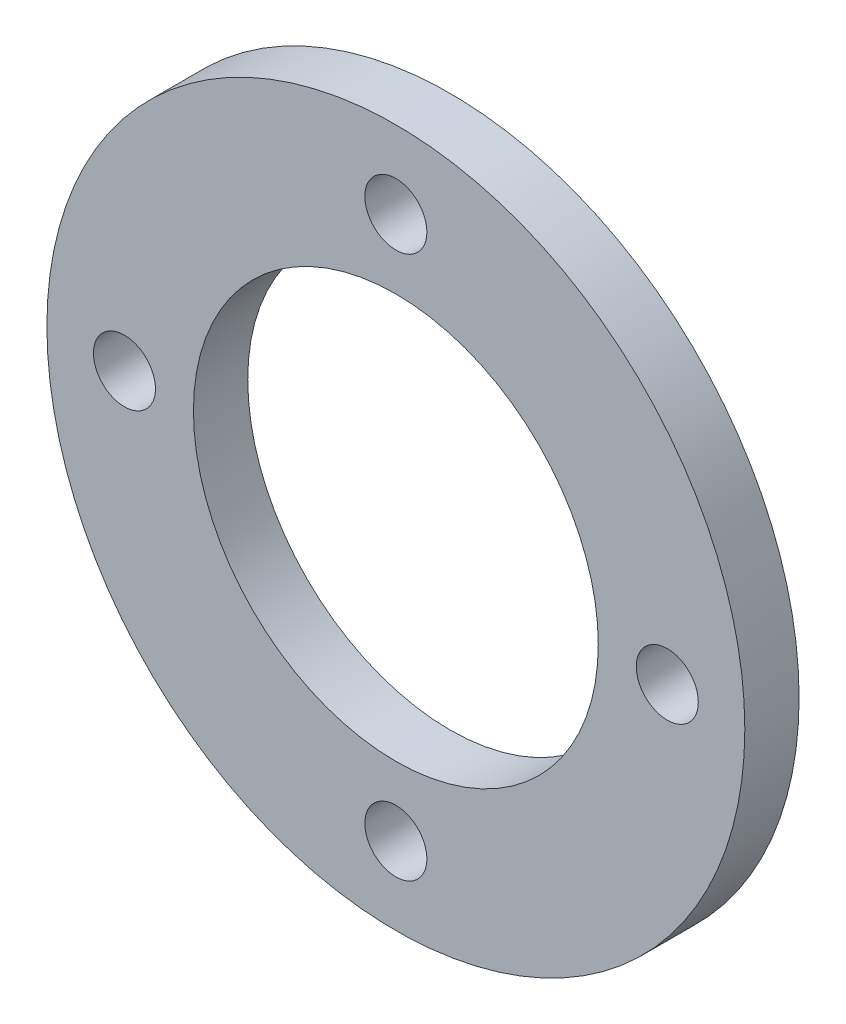
ISO-10303-21;
HEADER;
FILE_DESCRIPTION(('STEP AP214'),'2;1');
FILE_NAME('part.step','',(''),(''),'','','');
FILE_SCHEMA(('AUTOMOTIVE_DESIGN { 1 0 10303 214 1 1 1 1 }'));
ENDSEC;
DATA;
#1=APPLICATION_CONTEXT('core data for automotive mechanical design processes');
#2=APPLICATION_PROTOCOL_DEFINITION('international standard','automotive_design',2000,#1);
#3=PRODUCT_CONTEXT('',#1,'mechanical');
#4=PRODUCT('Part','Part','',(#3));
#5=PRODUCT_RELATED_PRODUCT_CATEGORY('part','',(#4));
#6=PRODUCT_DEFINITION_FORMATION('','',#4);
#7=PRODUCT_DEFINITION_CONTEXT('part definition',#1,'design');
#8=PRODUCT_DEFINITION('design','',#6,#7);
#9=PRODUCT_DEFINITION_SHAPE('','',#8);
#10=(LENGTH_UNIT() NAMED_UNIT(*) SI_UNIT(.MILLI.,.METRE.));
#11=(NAMED_UNIT(*) PLANE_ANGLE_UNIT() SI_UNIT($,.RADIAN.));
#12=(NAMED_UNIT(*) SI_UNIT($,.STERADIAN.) SOLID_ANGLE_UNIT());
#13=UNCERTAINTY_MEASURE_WITH_UNIT(LENGTH_MEASURE(1.E-05),#10,'distance_accuracy_value','');
#14=(GEOMETRIC_REPRESENTATION_CONTEXT(3) GLOBAL_UNCERTAINTY_ASSIGNED_CONTEXT((#13)) GLOBAL_UNIT_ASSIGNED_CONTEXT((#10,
#11,#12)) REPRESENTATION_CONTEXT('',''));
#15=CARTESIAN_POINT('',(0.,0.,0.));
#16=DIRECTION('',(0.,0.,1.));
#17=DIRECTION('',(1.,0.,0.));
#18=AXIS2_PLACEMENT_3D('',#15,#16,#17);
#19=CARTESIAN_POINT('',(0.,0.,7.));
#20=DIRECTION('',(0.,0.,-1.));
#21=DIRECTION('',(-1.,0.,0.));
#22=AXIS2_PLACEMENT_3D('',#19,#20,#21);
#23=CYLINDRICAL_SURFACE('',#22,45.);
#24=CARTESIAN_POINT('',(0.,0.,7.));
#25=DIRECTION('',(0.,0.,1.));
#26=DIRECTION('',(1.,0.,0.));
#27=AXIS2_PLACEMENT_3D('',#24,#25,#26);
#28=CIRCLE('',#27,45.);
#29=CARTESIAN_POINT('',(45.,0.,7.));
#30=VERTEX_POINT('',#29);
#31=EDGE_CURVE('E10',#30,#30,#28,.T.);
#32=ORIENTED_EDGE('',*,*,#31,.F.);
#33=EDGE_LOOP('',(#32));
#34=FACE_BOUND('',#33,.T.);
#35=CARTESIAN_POINT('',(0.,0.,0.));
#36=DIRECTION('',(0.,0.,1.));
#37=DIRECTION('',(1.,0.,0.));
#38=AXIS2_PLACEMENT_3D('',#35,#36,#37);
#39=CIRCLE('',#38,45.);
#40=CARTESIAN_POINT('',(45.,0.,0.));
#41=VERTEX_POINT('',#40);
#42=EDGE_CURVE('E39',#41,#41,#39,.T.);
#43=ORIENTED_EDGE('',*,*,#42,.T.);
#44=EDGE_LOOP('',(#43));
#45=FACE_BOUND('',#44,.T.);
#46=ADVANCED_FACE('F36',(#34,#45),#23,.T.);
#47=CARTESIAN_POINT('',(0.,0.,7.));
#48=DIRECTION('',(0.,0.,1.));
#49=DIRECTION('',(1.,0.,0.));
#50=AXIS2_PLACEMENT_3D('',#47,#48,#49);
#51=PLANE('',#50);
#52=CARTESIAN_POINT('',(0.,35.,7.));
#53=DIRECTION('',(0.,0.,1.));
#54=DIRECTION('',(1.,0.,0.));
#55=AXIS2_PLACEMENT_3D('',#52,#53,#54);
#56=CIRCLE('',#55,4.);
#57=CARTESIAN_POINT('',(4.,35.,7.));
#58=VERTEX_POINT('',#57);
#59=EDGE_CURVE('E72',#58,#58,#56,.T.);
#60=ORIENTED_EDGE('',*,*,#59,.F.);
#61=EDGE_LOOP('',(#60));
#62=FACE_BOUND('',#61,.T.);
#63=CARTESIAN_POINT('',(35.0000000000047,0.,7.));
#64=DIRECTION('',(0.,0.,1.));
#65=DIRECTION('',(1.,0.,0.));
#66=AXIS2_PLACEMENT_3D('',#63,#64,#65);
#67=CIRCLE('',#66,4.);
#68=CARTESIAN_POINT('',(39.0000000000047,0.,7.));
#69=VERTEX_POINT('',#68);
#70=EDGE_CURVE('E66',#69,#69,#67,.T.);
#71=ORIENTED_EDGE('',*,*,#70,.F.);
#72=EDGE_LOOP('',(#71));
#73=FACE_BOUND('',#72,.T.);
#74=CARTESIAN_POINT('',(4.66722296722298E-12,-35.0000000000047,7.));
#75=DIRECTION('',(0.,0.,1.));
#76=DIRECTION('',(1.,0.,0.));
#77=AXIS2_PLACEMENT_3D('',#74,#75,#76);
#78=CIRCLE('',#77,4.);
#79=CARTESIAN_POINT('',(4.00000000000467,-35.0000000000047,7.));
#80=VERTEX_POINT('',#79);
#81=EDGE_CURVE('E60',#80,#80,#78,.T.);
#82=ORIENTED_EDGE('',*,*,#81,.F.);
#83=EDGE_LOOP('',(#82));
#84=FACE_BOUND('',#83,.T.);
#85=CARTESIAN_POINT('',(-35.,-4.65599780952237E-12,7.));
#86=DIRECTION('',(0.,0.,1.));
#87=DIRECTION('',(1.,0.,0.));
#88=AXIS2_PLACEMENT_3D('',#85,#86,#87);
#89=CIRCLE('',#88,4.);
#90=CARTESIAN_POINT('',(-31.,-4.65599780952237E-12,7.));
#91=VERTEX_POINT('',#90);
#92=EDGE_CURVE('E54',#91,#91,#89,.T.);
#93=ORIENTED_EDGE('',*,*,#92,.F.);
#94=EDGE_LOOP('',(#93));
#95=FACE_BOUND('',#94,.T.);
#96=CARTESIAN_POINT('',(0.,0.,7.));
#97=DIRECTION('',(0.,0.,1.));
#98=DIRECTION('',(1.,0.,0.));
#99=AXIS2_PLACEMENT_3D('',#96,#97,#98);
#100=CIRCLE('',#99,26.1);
#101=CARTESIAN_POINT('',(26.1,0.,7.));
#102=VERTEX_POINT('',#101);
#103=EDGE_CURVE('E48',#102,#102,#100,.T.);
#104=ORIENTED_EDGE('',*,*,#103,.F.);
#105=EDGE_LOOP('',(#104));
#106=FACE_BOUND('',#105,.T.);
#107=ORIENTED_EDGE('',*,*,#31,.T.);
#108=EDGE_LOOP('',(#107));
#109=FACE_BOUND('',#108,.T.);
#110=ADVANCED_FACE('F88',(#62,#73,#84,#95,#106,#109),#51,.T.);
#111=CARTESIAN_POINT('',(0.,0.,0.));
#112=DIRECTION('',(0.,0.,1.));
#113=DIRECTION('',(1.,0.,0.));
#114=AXIS2_PLACEMENT_3D('',#111,#112,#113);
#115=PLANE('',#114);
#116=CARTESIAN_POINT('',(0.,35.,0.));
#117=DIRECTION('',(0.,0.,1.));
#118=DIRECTION('',(1.,0.,0.));
#119=AXIS2_PLACEMENT_3D('',#116,#117,#118);
#120=CIRCLE('',#119,4.);
#121=CARTESIAN_POINT('',(4.,35.,0.));
#122=VERTEX_POINT('',#121);
#123=EDGE_CURVE('E51',#122,#122,#120,.T.);
#124=ORIENTED_EDGE('',*,*,#123,.T.);
#125=EDGE_LOOP('',(#124));
#126=FACE_BOUND('',#125,.T.);
#127=CARTESIAN_POINT('',(35.0000000000047,0.,0.));
#128=DIRECTION('',(0.,0.,1.));
#129=DIRECTION('',(1.,0.,0.));
#130=AXIS2_PLACEMENT_3D('',#127,#128,#129);
#131=CIRCLE('',#130,4.);
#132=CARTESIAN_POINT('',(39.0000000000047,0.,0.));
#133=VERTEX_POINT('',#132);
#134=EDGE_CURVE('E69',#133,#133,#131,.T.);
#135=ORIENTED_EDGE('',*,*,#134,.T.);
#136=EDGE_LOOP('',(#135));
#137=FACE_BOUND('',#136,.T.);
#138=CARTESIAN_POINT('',(4.66722296722298E-12,-35.0000000000047,0.));
#139=DIRECTION('',(0.,0.,1.));
#140=DIRECTION('',(1.,0.,0.));
#141=AXIS2_PLACEMENT_3D('',#138,#139,#140);
#142=CIRCLE('',#141,4.);
#143=CARTESIAN_POINT('',(4.00000000000467,-35.0000000000047,0.));
#144=VERTEX_POINT('',#143);
#145=EDGE_CURVE('E63',#144,#144,#142,.T.);
#146=ORIENTED_EDGE('',*,*,#145,.T.);
#147=EDGE_LOOP('',(#146));
#148=FACE_BOUND('',#147,.T.);
#149=CARTESIAN_POINT('',(-35.,-4.65599780952237E-12,0.));
#150=DIRECTION('',(0.,0.,1.));
#151=DIRECTION('',(1.,0.,0.));
#152=AXIS2_PLACEMENT_3D('',#149,#150,#151);
#153=CIRCLE('',#152,4.);
#154=CARTESIAN_POINT('',(-31.,-4.65599780952237E-12,0.));
#155=VERTEX_POINT('',#154);
#156=EDGE_CURVE('E57',#155,#155,#153,.T.);
#157=ORIENTED_EDGE('',*,*,#156,.T.);
#158=EDGE_LOOP('',(#157));
#159=FACE_BOUND('',#158,.T.);
#160=CARTESIAN_POINT('',(0.,0.,0.));
#161=DIRECTION('',(0.,0.,1.));
#162=DIRECTION('',(1.,0.,0.));
#163=AXIS2_PLACEMENT_3D('',#160,#161,#162);
#164=CIRCLE('',#163,26.1);
#165=CARTESIAN_POINT('',(26.1,0.,0.));
#166=VERTEX_POINT('',#165);
#167=EDGE_CURVE('E46',#166,#166,#164,.T.);
#168=ORIENTED_EDGE('',*,*,#167,.T.);
#169=EDGE_LOOP('',(#168));
#170=FACE_BOUND('',#169,.T.);
#171=ORIENTED_EDGE('',*,*,#42,.F.);
#172=EDGE_LOOP('',(#171));
#173=FACE_BOUND('',#172,.T.);
#174=ADVANCED_FACE('F78',(#126,#137,#148,#159,#170,#173),#115,.F.);
#175=CARTESIAN_POINT('',(0.,0.,0.));
#176=DIRECTION('',(0.,0.,1.));
#177=DIRECTION('',(1.,0.,0.));
#178=AXIS2_PLACEMENT_3D('',#175,#176,#177);
#179=CYLINDRICAL_SURFACE('',#178,26.1);
#180=ORIENTED_EDGE('',*,*,#167,.F.);
#181=EDGE_LOOP('',(#180));
#182=FACE_BOUND('',#181,.T.);
#183=ORIENTED_EDGE('',*,*,#103,.T.);
#184=EDGE_LOOP('',(#183));
#185=FACE_BOUND('',#184,.T.);
#186=ADVANCED_FACE('F100',(#182,#185),#179,.F.);
#187=CARTESIAN_POINT('',(-35.,-4.65599780952237E-12,0.));
#188=DIRECTION('',(0.,0.,1.));
#189=DIRECTION('',(1.,0.,0.));
#190=AXIS2_PLACEMENT_3D('',#187,#188,#189);
#191=CYLINDRICAL_SURFACE('',#190,4.);
#192=ORIENTED_EDGE('',*,*,#156,.F.);
#193=EDGE_LOOP('',(#192));
#194=FACE_BOUND('',#193,.T.);
#195=ORIENTED_EDGE('',*,*,#92,.T.);
#196=EDGE_LOOP('',(#195));
#197=FACE_BOUND('',#196,.T.);
#198=ADVANCED_FACE('F102',(#194,#197),#191,.F.);
#199=CARTESIAN_POINT('',(4.66722296722298E-12,-35.0000000000047,0.));
#200=DIRECTION('',(0.,0.,1.));
#201=DIRECTION('',(1.,0.,0.));
#202=AXIS2_PLACEMENT_3D('',#199,#200,#201);
#203=CYLINDRICAL_SURFACE('',#202,4.);
#204=ORIENTED_EDGE('',*,*,#145,.F.);
#205=EDGE_LOOP('',(#204));
#206=FACE_BOUND('',#205,.T.);
#207=ORIENTED_EDGE('',*,*,#81,.T.);
#208=EDGE_LOOP('',(#207));
#209=FACE_BOUND('',#208,.T.);
#210=ADVANCED_FACE('F109',(#206,#209),#203,.F.);
#211=CARTESIAN_POINT('',(35.0000000000047,0.,0.));
#212=DIRECTION('',(0.,0.,1.));
#213=DIRECTION('',(1.,0.,0.));
#214=AXIS2_PLACEMENT_3D('',#211,#212,#213);
#215=CYLINDRICAL_SURFACE('',#214,4.);
#216=ORIENTED_EDGE('',*,*,#134,.F.);
#217=EDGE_LOOP('',(#216));
#218=FACE_BOUND('',#217,.T.);
#219=ORIENTED_EDGE('',*,*,#70,.T.);
#220=EDGE_LOOP('',(#219));
#221=FACE_BOUND('',#220,.T.);
#222=ADVANCED_FACE('F84',(#218,#221),#215,.F.);
#223=CARTESIAN_POINT('',(0.,35.,0.));
#224=DIRECTION('',(0.,0.,1.));
#225=DIRECTION('',(1.,0.,0.));
#226=AXIS2_PLACEMENT_3D('',#223,#224,#225);
#227=CYLINDRICAL_SURFACE('',#226,4.);
#228=ORIENTED_EDGE('',*,*,#123,.F.);
#229=EDGE_LOOP('',(#228));
#230=FACE_BOUND('',#229,.T.);
#231=ORIENTED_EDGE('',*,*,#59,.T.);
#232=EDGE_LOOP('',(#231));
#233=FACE_BOUND('',#232,.T.);
#234=ADVANCED_FACE('F81',(#230,#233),#227,.F.);
#235=CLOSED_SHELL('',(#46,#110,#174,#186,#198,#210,#222,#234));
#236=MANIFOLD_SOLID_BREP('B2',#235);
#237=ADVANCED_BREP_SHAPE_REPRESENTATION('',(#18,#236),#14);
#238=SHAPE_DEFINITION_REPRESENTATION(#9,#237);
ENDSEC;
END-ISO-10303-21;
